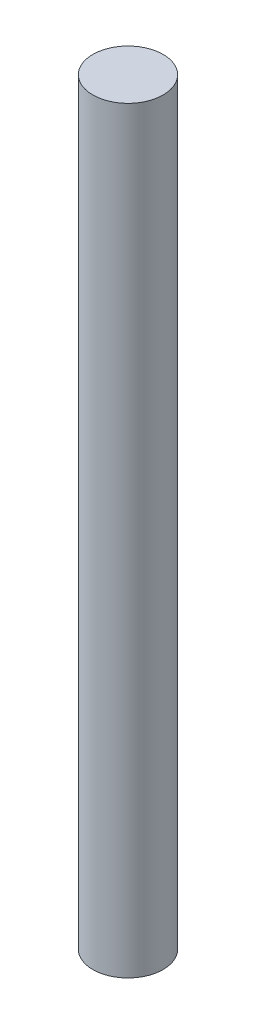
ISO-10303-21;
HEADER;
FILE_DESCRIPTION(('STEP AP214'),'2;1');
FILE_NAME('part.step','',(''),(''),'','','');
FILE_SCHEMA(('AUTOMOTIVE_DESIGN { 1 0 10303 214 1 1 1 1 }'));
ENDSEC;
DATA;
#1=APPLICATION_CONTEXT('core data for automotive mechanical design processes');
#2=APPLICATION_PROTOCOL_DEFINITION('international standard','automotive_design',2000,#1);
#3=PRODUCT_CONTEXT('',#1,'mechanical');
#4=PRODUCT('Part','Part','',(#3));
#5=PRODUCT_RELATED_PRODUCT_CATEGORY('part','',(#4));
#6=PRODUCT_DEFINITION_FORMATION('','',#4);
#7=PRODUCT_DEFINITION_CONTEXT('part definition',#1,'design');
#8=PRODUCT_DEFINITION('design','',#6,#7);
#9=PRODUCT_DEFINITION_SHAPE('','',#8);
#10=(LENGTH_UNIT() NAMED_UNIT(*) SI_UNIT(.MILLI.,.METRE.));
#11=(NAMED_UNIT(*) PLANE_ANGLE_UNIT() SI_UNIT($,.RADIAN.));
#12=(NAMED_UNIT(*) SI_UNIT($,.STERADIAN.) SOLID_ANGLE_UNIT());
#13=UNCERTAINTY_MEASURE_WITH_UNIT(LENGTH_MEASURE(1.E-05),#10,'distance_accuracy_value','');
#14=(GEOMETRIC_REPRESENTATION_CONTEXT(3) GLOBAL_UNCERTAINTY_ASSIGNED_CONTEXT((#13)) GLOBAL_UNIT_ASSIGNED_CONTEXT((#10,
#11,#12)) REPRESENTATION_CONTEXT('',''));
#15=CARTESIAN_POINT('',(0.,0.,0.));
#16=DIRECTION('',(0.,0.,1.));
#17=DIRECTION('',(1.,0.,0.));
#18=AXIS2_PLACEMENT_3D('',#15,#16,#17);
#19=CARTESIAN_POINT('',(0.,95.,0.));
#20=DIRECTION('',(0.,-1.,0.));
#21=DIRECTION('',(0.,0.,-1.));
#22=AXIS2_PLACEMENT_3D('',#19,#20,#21);
#23=CYLINDRICAL_SURFACE('',#22,4.);
#24=CARTESIAN_POINT('',(0.,0.,0.));
#25=DIRECTION('',(0.,1.,0.));
#26=DIRECTION('',(0.,0.,1.));
#27=AXIS2_PLACEMENT_3D('',#24,#25,#26);
#28=CIRCLE('',#27,4.);
#29=CARTESIAN_POINT('',(0.,0.,4.));
#30=VERTEX_POINT('',#29);
#31=EDGE_CURVE('E10',#30,#30,#28,.T.);
#32=ORIENTED_EDGE('',*,*,#31,.T.);
#33=EDGE_LOOP('',(#32));
#34=FACE_BOUND('',#33,.T.);
#35=CARTESIAN_POINT('',(0.,86.25,0.));
#36=DIRECTION('',(0.,1.,0.));
#37=DIRECTION('',(0.,0.,1.));
#38=AXIS2_PLACEMENT_3D('',#35,#36,#37);
#39=CIRCLE('',#38,4.);
#40=CARTESIAN_POINT('',(0.,86.25,4.));
#41=VERTEX_POINT('',#40);
#42=EDGE_CURVE('E48',#41,#41,#39,.T.);
#43=ORIENTED_EDGE('',*,*,#42,.F.);
#44=EDGE_LOOP('',(#43));
#45=FACE_BOUND('',#44,.T.);
#46=ADVANCED_FACE('F42',(#34,#45),#23,.T.);
#47=CARTESIAN_POINT('',(0.,0.,0.));
#48=DIRECTION('',(0.,1.,0.));
#49=DIRECTION('',(0.,0.,1.));
#50=AXIS2_PLACEMENT_3D('',#47,#48,#49);
#51=PLANE('',#50);
#52=ORIENTED_EDGE('',*,*,#31,.F.);
#53=EDGE_LOOP('',(#52));
#54=FACE_BOUND('',#53,.T.);
#55=ADVANCED_FACE('F57',(#54),#51,.F.);
#56=CARTESIAN_POINT('',(0.,86.25,0.));
#57=DIRECTION('',(0.,1.,0.));
#58=DIRECTION('',(0.,0.,1.));
#59=AXIS2_PLACEMENT_3D('',#56,#57,#58);
#60=PLANE('',#59);
#61=ORIENTED_EDGE('',*,*,#42,.T.);
#62=EDGE_LOOP('',(#61));
#63=FACE_BOUND('',#62,.T.);
#64=ADVANCED_FACE('F54',(#63),#60,.T.);
#65=CLOSED_SHELL('',(#46,#55,#64));
#66=MANIFOLD_SOLID_BREP('B2',#65);
#67=ADVANCED_BREP_SHAPE_REPRESENTATION('',(#18,#66),#14);
#68=SHAPE_DEFINITION_REPRESENTATION(#9,#67);
ENDSEC;
END-ISO-10303-21;
